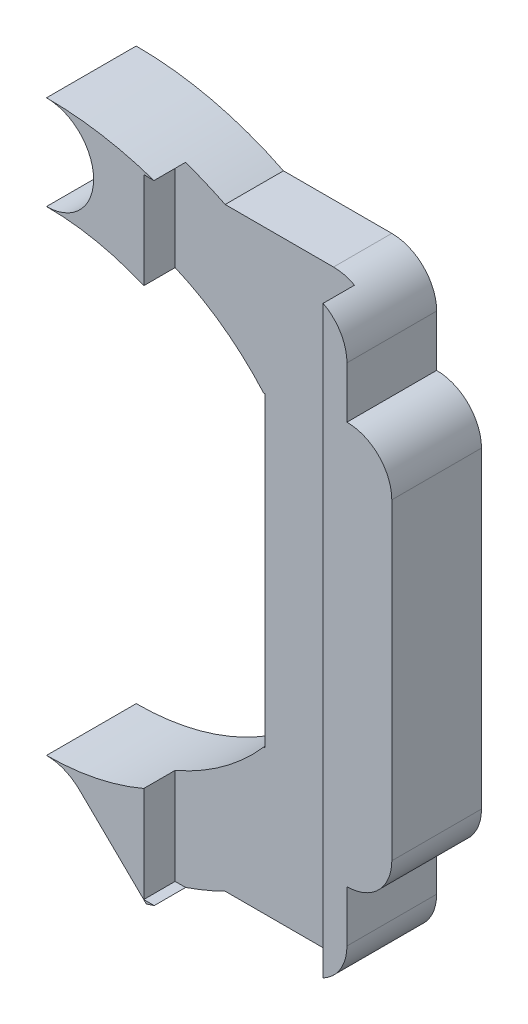
ISO-10303-21;
HEADER;
FILE_DESCRIPTION(('STEP AP214'),'2;1');
FILE_NAME('part.step','',(''),(''),'','','');
FILE_SCHEMA(('AUTOMOTIVE_DESIGN { 1 0 10303 214 1 1 1 1 }'));
ENDSEC;
DATA;
#1=APPLICATION_CONTEXT('core data for automotive mechanical design processes');
#2=APPLICATION_PROTOCOL_DEFINITION('international standard','automotive_design',2000,#1);
#3=PRODUCT_CONTEXT('',#1,'mechanical');
#4=PRODUCT('Part','Part','',(#3));
#5=PRODUCT_RELATED_PRODUCT_CATEGORY('part','',(#4));
#6=PRODUCT_DEFINITION_FORMATION('','',#4);
#7=PRODUCT_DEFINITION_CONTEXT('part definition',#1,'design');
#8=PRODUCT_DEFINITION('design','',#6,#7);
#9=PRODUCT_DEFINITION_SHAPE('','',#8);
#10=(LENGTH_UNIT() NAMED_UNIT(*) SI_UNIT(.MILLI.,.METRE.));
#11=(NAMED_UNIT(*) PLANE_ANGLE_UNIT() SI_UNIT($,.RADIAN.));
#12=(NAMED_UNIT(*) SI_UNIT($,.STERADIAN.) SOLID_ANGLE_UNIT());
#13=UNCERTAINTY_MEASURE_WITH_UNIT(LENGTH_MEASURE(1.E-05),#10,'distance_accuracy_value','');
#14=(GEOMETRIC_REPRESENTATION_CONTEXT(3) GLOBAL_UNCERTAINTY_ASSIGNED_CONTEXT((#13)) GLOBAL_UNIT_ASSIGNED_CONTEXT((#10,
#11,#12)) REPRESENTATION_CONTEXT('',''));
#15=CARTESIAN_POINT('',(0.,0.,0.));
#16=DIRECTION('',(0.,0.,1.));
#17=DIRECTION('',(1.,0.,0.));
#18=AXIS2_PLACEMENT_3D('',#15,#16,#17);
#19=CARTESIAN_POINT('',(0.,-137.488886753893,91.8986686213151));
#20=DIRECTION('',(0.,-1.,0.));
#21=DIRECTION('',(0.,0.,-1.));
#22=AXIS2_PLACEMENT_3D('',#19,#20,#21);
#23=PLANE('',#22);
#24=DIRECTION('',(-1.,0.,0.));
#25=VECTOR('',#24,1.);
#26=CARTESIAN_POINT('',(0.,-137.488886753893,6.50000000000001));
#27=LINE('',#26,#25);
#28=CARTESIAN_POINT('',(-19.5929771354829,-137.488886753893,6.50000000000001));
#29=VERTEX_POINT('',#28);
#30=CARTESIAN_POINT('',(-31.6731630647433,-137.488886753893,6.50000000000001));
#31=VERTEX_POINT('',#30);
#32=EDGE_CURVE('E290',#29,#31,#27,.T.);
#33=ORIENTED_EDGE('',*,*,#32,.F.);
#34=DIRECTION('',(0.,0.,-1.));
#35=VECTOR('',#34,1.);
#36=CARTESIAN_POINT('',(-19.5929771354829,-137.488886753893,91.8986686213151));
#37=LINE('',#36,#35);
#38=CARTESIAN_POINT('',(-19.5929771354829,-137.488886753893,0.));
#39=VERTEX_POINT('',#38);
#40=EDGE_CURVE('E344',#29,#39,#37,.T.);
#41=ORIENTED_EDGE('',*,*,#40,.T.);
#42=DIRECTION('',(-1.,0.,0.));
#43=VECTOR('',#42,1.);
#44=CARTESIAN_POINT('',(0.,-137.488886753893,0.));
#45=LINE('',#44,#43);
#46=CARTESIAN_POINT('',(-31.6731630647434,-137.488886753893,0.));
#47=VERTEX_POINT('',#46);
#48=EDGE_CURVE('E341',#39,#47,#45,.T.);
#49=ORIENTED_EDGE('',*,*,#48,.T.);
#50=DIRECTION('',(0.,0.,-1.));
#51=VECTOR('',#50,1.);
#52=CARTESIAN_POINT('',(-31.6731630647434,-137.488886753893,91.8986686213151));
#53=LINE('',#52,#51);
#54=EDGE_CURVE('E340',#31,#47,#53,.T.);
#55=ORIENTED_EDGE('',*,*,#54,.F.);
#56=EDGE_LOOP('',(#33,#41,#49,#55));
#57=FACE_BOUND('',#56,.T.);
#58=ADVANCED_FACE('F36',(#57),#23,.F.);
#59=CARTESIAN_POINT('',(10.5655699781385,-150.905438378479,91.8986686213151));
#60=DIRECTION('',(0.0698435294012636,-0.997557958918064,0.));
#61=DIRECTION('',(0.997557958918065,0.0698435294012636,0.));
#62=AXIS2_PLACEMENT_3D('',#59,#60,#61);
#63=PLANE('',#62);
#64=DIRECTION('',(0.,0.,-1.));
#65=VECTOR('',#64,1.);
#66=CARTESIAN_POINT('',(-27.2504123253833,-153.553105762856,91.8986686213151));
#67=LINE('',#66,#65);
#68=CARTESIAN_POINT('',(-27.2504123253833,-153.553105762856,6.50000000000001));
#69=VERTEX_POINT('',#68);
#70=CARTESIAN_POINT('',(-27.2504123253833,-153.553105762856,0.));
#71=VERTEX_POINT('',#70);
#72=EDGE_CURVE('E425',#69,#71,#67,.T.);
#73=ORIENTED_EDGE('',*,*,#72,.F.);
#74=DIRECTION('',(-0.997557958918065,-0.0698435294012636,0.));
#75=VECTOR('',#74,1.);
#76=CARTESIAN_POINT('',(10.5655699781385,-150.905438378479,6.50000000000001));
#77=LINE('',#76,#75);
#78=CARTESIAN_POINT('',(-27.375441214953,-153.561859599008,6.50000000000001));
#79=VERTEX_POINT('',#78);
#80=EDGE_CURVE('E282',#69,#79,#77,.T.);
#81=ORIENTED_EDGE('',*,*,#80,.T.);
#82=DIRECTION('',(0.,0.,-1.));
#83=VECTOR('',#82,1.);
#84=CARTESIAN_POINT('',(-27.375441214953,-153.561859599008,91.8986686213151));
#85=LINE('',#84,#83);
#86=CARTESIAN_POINT('',(-27.375441214953,-153.561859599008,0.));
#87=VERTEX_POINT('',#86);
#88=EDGE_CURVE('E423',#79,#87,#85,.T.);
#89=ORIENTED_EDGE('',*,*,#88,.T.);
#90=DIRECTION('',(-0.997557958918065,-0.0698435294012636,0.));
#91=VECTOR('',#90,1.);
#92=CARTESIAN_POINT('',(10.5655699781385,-150.905438378479,0.));
#93=LINE('',#92,#91);
#94=EDGE_CURVE('E325',#71,#87,#93,.T.);
#95=ORIENTED_EDGE('',*,*,#94,.F.);
#96=EDGE_LOOP('',(#73,#81,#89,#95));
#97=FACE_BOUND('',#96,.T.);
#98=ADVANCED_FACE('F467',(#97),#63,.T.);
#99=CARTESIAN_POINT('',(-27.2504123253833,0.,91.8986686213151));
#100=DIRECTION('',(-1.,0.,0.));
#101=DIRECTION('',(0.,0.,1.));
#102=AXIS2_PLACEMENT_3D('',#99,#100,#101);
#103=PLANE('',#102);
#104=DIRECTION('',(0.,0.,-1.));
#105=VECTOR('',#104,1.);
#106=CARTESIAN_POINT('',(-27.2504123253833,-187.730006102893,91.8986686213151));
#107=LINE('',#106,#105);
#108=CARTESIAN_POINT('',(-27.2504123253833,-187.730006102893,6.50000000000001));
#109=VERTEX_POINT('',#108);
#110=CARTESIAN_POINT('',(-27.2504123253833,-187.730006102893,0.));
#111=VERTEX_POINT('',#110);
#112=EDGE_CURVE('E385',#109,#111,#107,.T.);
#113=ORIENTED_EDGE('',*,*,#112,.F.);
#114=DIRECTION('',(0.,1.,0.));
#115=VECTOR('',#114,1.);
#116=CARTESIAN_POINT('',(-27.2504123253833,0.,6.50000000000001));
#117=LINE('',#116,#115);
#118=EDGE_CURVE('E279',#109,#69,#117,.T.);
#119=ORIENTED_EDGE('',*,*,#118,.T.);
#120=ORIENTED_EDGE('',*,*,#72,.T.);
#121=DIRECTION('',(0.,1.,0.));
#122=VECTOR('',#121,1.);
#123=CARTESIAN_POINT('',(-27.2504123253833,0.,0.));
#124=LINE('',#123,#122);
#125=EDGE_CURVE('E322',#111,#71,#124,.T.);
#126=ORIENTED_EDGE('',*,*,#125,.F.);
#127=EDGE_LOOP('',(#113,#119,#120,#126));
#128=FACE_BOUND('',#127,.T.);
#129=ADVANCED_FACE('F470',(#128),#103,.T.);
#130=CARTESIAN_POINT('',(0.,-187.730006102893,91.8986686213151));
#131=DIRECTION('',(0.,1.,0.));
#132=DIRECTION('',(0.,0.,1.));
#133=AXIS2_PLACEMENT_3D('',#130,#131,#132);
#134=PLANE('',#133);
#135=DIRECTION('',(0.,0.,-1.));
#136=VECTOR('',#135,1.);
#137=CARTESIAN_POINT('',(-27.375441214953,-187.730006102893,91.8986686213151));
#138=LINE('',#137,#136);
#139=CARTESIAN_POINT('',(-27.375441214953,-187.730006102893,6.50000000000001));
#140=VERTEX_POINT('',#139);
#141=CARTESIAN_POINT('',(-27.375441214953,-187.730006102893,0.));
#142=VERTEX_POINT('',#141);
#143=EDGE_CURVE('E384',#140,#142,#138,.T.);
#144=ORIENTED_EDGE('',*,*,#143,.F.);
#145=DIRECTION('',(1.,0.,0.));
#146=VECTOR('',#145,1.);
#147=CARTESIAN_POINT('',(0.,-187.730006102893,6.50000000000001));
#148=LINE('',#147,#146);
#149=EDGE_CURVE('E276',#140,#109,#148,.T.);
#150=ORIENTED_EDGE('',*,*,#149,.T.);
#151=ORIENTED_EDGE('',*,*,#112,.T.);
#152=DIRECTION('',(1.,0.,0.));
#153=VECTOR('',#152,1.);
#154=CARTESIAN_POINT('',(0.,-187.730006102893,0.));
#155=LINE('',#154,#153);
#156=EDGE_CURVE('E319',#142,#111,#155,.T.);
#157=ORIENTED_EDGE('',*,*,#156,.F.);
#158=EDGE_LOOP('',(#144,#150,#151,#157));
#159=FACE_BOUND('',#158,.T.);
#160=ADVANCED_FACE('F475',(#159),#134,.T.);
#161=CARTESIAN_POINT('',(0.,-203.802633979979,91.8986686213151));
#162=DIRECTION('',(0.,-1.,0.));
#163=DIRECTION('',(0.,0.,-1.));
#164=AXIS2_PLACEMENT_3D('',#161,#162,#163);
#165=PLANE('',#164);
#166=DIRECTION('',(0.,0.,-1.));
#167=VECTOR('',#166,1.);
#168=CARTESIAN_POINT('',(-19.5945961650131,-203.802633979979,91.8986686213151));
#169=LINE('',#168,#167);
#170=CARTESIAN_POINT('',(-19.5945961650131,-203.802633979979,6.50000000000001));
#171=VERTEX_POINT('',#170);
#172=CARTESIAN_POINT('',(-19.5945961650131,-203.802633979979,0.));
#173=VERTEX_POINT('',#172);
#174=EDGE_CURVE('E299',#171,#173,#169,.T.);
#175=ORIENTED_EDGE('',*,*,#174,.F.);
#176=DIRECTION('',(-1.,0.,0.));
#177=VECTOR('',#176,1.);
#178=CARTESIAN_POINT('',(0.,-203.802633979979,6.50000000000001));
#179=LINE('',#178,#177);
#180=CARTESIAN_POINT('',(-31.6724659617037,-203.802633979979,6.50000000000001));
#181=VERTEX_POINT('',#180);
#182=EDGE_CURVE('E270',#171,#181,#179,.T.);
#183=ORIENTED_EDGE('',*,*,#182,.T.);
#184=DIRECTION('',(0.,0.,-1.));
#185=VECTOR('',#184,1.);
#186=CARTESIAN_POINT('',(-31.6724659617037,-203.802633979979,91.8986686213151));
#187=LINE('',#186,#185);
#188=CARTESIAN_POINT('',(-31.6724659617037,-203.802633979979,0.));
#189=VERTEX_POINT('',#188);
#190=EDGE_CURVE('E307',#181,#189,#187,.T.);
#191=ORIENTED_EDGE('',*,*,#190,.T.);
#192=DIRECTION('',(-1.,0.,0.));
#193=VECTOR('',#192,1.);
#194=CARTESIAN_POINT('',(0.,-203.802633979979,0.));
#195=LINE('',#194,#193);
#196=EDGE_CURVE('E300',#173,#189,#195,.T.);
#197=ORIENTED_EDGE('',*,*,#196,.F.);
#198=EDGE_LOOP('',(#175,#183,#191,#197));
#199=FACE_BOUND('',#198,.T.);
#200=ADVANCED_FACE('F489',(#199),#165,.T.);
#201=CARTESIAN_POINT('',(0.,0.,10.));
#202=DIRECTION('',(0.,0.,1.));
#203=DIRECTION('',(1.,0.,0.));
#204=AXIS2_PLACEMENT_3D('',#201,#202,#203);
#205=PLANE('',#204);
#206=DIRECTION('',(0.,-1.,0.));
#207=VECTOR('',#206,1.);
#208=CARTESIAN_POINT('',(-37.2504123253833,-205.641555932874,10.));
#209=LINE('',#208,#207);
#210=CARTESIAN_POINT('',(-37.2504123253834,-135.641555932875,10.));
#211=VERTEX_POINT('',#210);
#212=CARTESIAN_POINT('',(-37.2504123253834,-146.373639952624,10.));
#213=VERTEX_POINT('',#212);
#214=EDGE_CURVE('E251',#211,#213,#209,.T.);
#215=ORIENTED_EDGE('',*,*,#214,.F.);
#216=DIRECTION('',(-1.,0.,0.));
#217=VECTOR('',#216,1.);
#218=CARTESIAN_POINT('',(1.87350135405495E-13,-135.641555932874,10.));
#219=LINE('',#218,#217);
#220=CARTESIAN_POINT('',(-36.105750743306,-135.641555932875,10.));
#221=VERTEX_POINT('',#220);
#222=EDGE_CURVE('E44',#221,#211,#219,.T.);
#223=ORIENTED_EDGE('',*,*,#222,.F.);
#224=CARTESIAN_POINT('',(-48.0929771354814,-170.645932850957,9.99999999999999));
#225=DIRECTION('',(0.,0.,1.));
#226=DIRECTION('',(1.,0.,0.));
#227=AXIS2_PLACEMENT_3D('',#224,#225,#226);
#228=CIRCLE('',#227,37.0000000000059);
#229=CARTESIAN_POINT('',(-48.0929771354812,-133.645932850951,9.99999999999999));
#230=VERTEX_POINT('',#229);
#231=EDGE_CURVE('E390',#221,#230,#228,.T.);
#232=ORIENTED_EDGE('',*,*,#231,.T.);
#233=CARTESIAN_POINT('',(-48.0929771354814,-138.895932850951,9.99999999999999));
#234=DIRECTION('',(0.,0.,1.));
#235=DIRECTION('',(1.,0.,0.));
#236=AXIS2_PLACEMENT_3D('',#233,#234,#235);
#237=CIRCLE('',#236,5.25);
#238=CARTESIAN_POINT('',(-48.0929771354816,-144.145932850951,9.99999999999999));
#239=VERTEX_POINT('',#238);
#240=EDGE_CURVE('E380',#230,#239,#237,.F.);
#241=ORIENTED_EDGE('',*,*,#240,.T.);
#242=CARTESIAN_POINT('',(-48.0929771354814,-171.645932850951,9.99999999999999));
#243=DIRECTION('',(0.,0.,1.));
#244=DIRECTION('',(1.,0.,0.));
#245=AXIS2_PLACEMENT_3D('',#242,#243,#244);
#246=CIRCLE('',#245,27.5);
#247=EDGE_CURVE('E335',#213,#239,#246,.T.);
#248=ORIENTED_EDGE('',*,*,#247,.F.);
#249=EDGE_LOOP('',(#215,#223,#232,#241,#248));
#250=FACE_BOUND('',#249,.T.);
#251=ADVANCED_FACE('F450',(#250),#205,.T.);
#252=DIRECTION('',(0.,1.,0.));
#253=VECTOR('',#252,1.);
#254=CARTESIAN_POINT('',(-17.2504123253834,0.,10.));
#255=LINE('',#254,#253);
#256=CARTESIAN_POINT('',(-17.2504123253833,-203.219058113373,10.));
#257=VERTEX_POINT('',#256);
#258=CARTESIAN_POINT('',(-17.2504123253833,-138.071603639751,10.));
#259=VERTEX_POINT('',#258);
#260=EDGE_CURVE('E436',#257,#259,#255,.T.);
#261=ORIENTED_EDGE('',*,*,#260,.F.);
#262=CARTESIAN_POINT('',(-19.594596165013,-198.802633979979,9.99999999999999));
#263=DIRECTION('',(0.,0.,1.));
#264=DIRECTION('',(1.,0.,0.));
#265=AXIS2_PLACEMENT_3D('',#262,#263,#264);
#266=CIRCLE('',#265,5.);
#267=CARTESIAN_POINT('',(-14.594596165013,-198.802633979979,9.99999999999999));
#268=VERTEX_POINT('',#267);
#269=EDGE_CURVE('E59',#257,#268,#266,.T.);
#270=ORIENTED_EDGE('',*,*,#269,.T.);
#271=DIRECTION('',(0.,-1.,0.));
#272=VECTOR('',#271,1.);
#273=CARTESIAN_POINT('',(-14.594596165013,0.,9.99999999999999));
#274=LINE('',#273,#272);
#275=CARTESIAN_POINT('',(-14.594596165013,-193.072403439186,9.99999999999999));
#276=VERTEX_POINT('',#275);
#277=EDGE_CURVE('E294',#276,#268,#274,.T.);
#278=ORIENTED_EDGE('',*,*,#277,.F.);
#279=DIRECTION('',(1.,0.,0.));
#280=VECTOR('',#279,1.);
#281=CARTESIAN_POINT('',(0.,-193.072403439186,9.99999999999999));
#282=LINE('',#281,#280);
#283=CARTESIAN_POINT('',(-14.5929771354816,-193.072403439186,9.99999999999999));
#284=VERTEX_POINT('',#283);
#285=EDGE_CURVE('E331',#276,#284,#282,.T.);
#286=ORIENTED_EDGE('',*,*,#285,.T.);
#287=CARTESIAN_POINT('',(-14.5929771354816,-188.072403439186,9.99999999999999));
#288=DIRECTION('',(0.,0.,1.));
#289=DIRECTION('',(1.,0.,0.));
#290=AXIS2_PLACEMENT_3D('',#287,#288,#289);
#291=CIRCLE('',#290,5.);
#292=CARTESIAN_POINT('',(-9.59297713548164,-188.072403439186,9.99999999999999));
#293=VERTEX_POINT('',#292);
#294=EDGE_CURVE('E404',#284,#293,#291,.T.);
#295=ORIENTED_EDGE('',*,*,#294,.T.);
#296=DIRECTION('',(0.,1.,0.));
#297=VECTOR('',#296,1.);
#298=CARTESIAN_POINT('',(-9.59297713548166,0.,9.99999999999999));
#299=LINE('',#298,#297);
#300=CARTESIAN_POINT('',(-9.59297713548165,-153.219462262715,9.99999999999999));
#301=VERTEX_POINT('',#300);
#302=EDGE_CURVE('E401',#293,#301,#299,.T.);
#303=ORIENTED_EDGE('',*,*,#302,.T.);
#304=CARTESIAN_POINT('',(-14.5929771354816,-153.219462262715,9.99999999999999));
#305=DIRECTION('',(0.,0.,1.));
#306=DIRECTION('',(1.,0.,0.));
#307=AXIS2_PLACEMENT_3D('',#304,#305,#306);
#308=CIRCLE('',#307,5.);
#309=CARTESIAN_POINT('',(-14.5929771354816,-148.219462262715,9.99999999999999));
#310=VERTEX_POINT('',#309);
#311=EDGE_CURVE('E398',#301,#310,#308,.T.);
#312=ORIENTED_EDGE('',*,*,#311,.T.);
#313=DIRECTION('',(-2.06753428563697E-13,1.,0.));
#314=VECTOR('',#313,1.);
#315=CARTESIAN_POINT('',(-14.5929771355123,-3.02535774210355E-12,9.99999999999999));
#316=LINE('',#315,#314);
#317=CARTESIAN_POINT('',(-14.5929771354828,-142.488886753893,9.99999999999999));
#318=VERTEX_POINT('',#317);
#319=EDGE_CURVE('E395',#310,#318,#316,.T.);
#320=ORIENTED_EDGE('',*,*,#319,.T.);
#321=CARTESIAN_POINT('',(-19.5929771354828,-142.488886753893,9.99999999999999));
#322=DIRECTION('',(0.,0.,1.));
#323=DIRECTION('',(1.,0.,0.));
#324=AXIS2_PLACEMENT_3D('',#321,#322,#323);
#325=CIRCLE('',#324,5.);
#326=EDGE_CURVE('E392',#318,#259,#325,.T.);
#327=ORIENTED_EDGE('',*,*,#326,.T.);
#328=EDGE_LOOP('',(#261,#270,#278,#286,#295,#303,#312,#320,#327));
#329=FACE_BOUND('',#328,.T.);
#330=ADVANCED_FACE('F504',(#329),#205,.T.);
#331=CARTESIAN_POINT('',(-14.594596165013,0.,91.8986686213151));
#332=DIRECTION('',(1.,0.,0.));
#333=DIRECTION('',(0.,0.,-1.));
#334=AXIS2_PLACEMENT_3D('',#331,#332,#333);
#335=PLANE('',#334);
#336=DIRECTION('',(0.,0.,-1.));
#337=VECTOR('',#336,1.);
#338=CARTESIAN_POINT('',(-14.594596165013,-193.072403439186,91.8986686213151));
#339=LINE('',#338,#337);
#340=CARTESIAN_POINT('',(-14.594596165013,-193.072403439186,0.));
#341=VERTEX_POINT('',#340);
#342=EDGE_CURVE('E368',#276,#341,#339,.T.);
#343=ORIENTED_EDGE('',*,*,#342,.F.);
#344=ORIENTED_EDGE('',*,*,#277,.T.);
#345=DIRECTION('',(0.,0.,-1.));
#346=VECTOR('',#345,1.);
#347=CARTESIAN_POINT('',(-14.594596165013,-198.802633979979,91.8986686213151));
#348=LINE('',#347,#346);
#349=CARTESIAN_POINT('',(-14.594596165013,-198.802633979979,0.));
#350=VERTEX_POINT('',#349);
#351=EDGE_CURVE('E411',#268,#350,#348,.T.);
#352=ORIENTED_EDGE('',*,*,#351,.T.);
#353=DIRECTION('',(0.,-1.,0.));
#354=VECTOR('',#353,1.);
#355=CARTESIAN_POINT('',(-14.594596165013,0.,0.));
#356=LINE('',#355,#354);
#357=EDGE_CURVE('E298',#341,#350,#356,.T.);
#358=ORIENTED_EDGE('',*,*,#357,.F.);
#359=EDGE_LOOP('',(#343,#344,#352,#358));
#360=FACE_BOUND('',#359,.T.);
#361=ADVANCED_FACE('F500',(#360),#335,.T.);
#362=CARTESIAN_POINT('',(0.,-193.072403439186,91.8986686213151));
#363=DIRECTION('',(0.,1.,0.));
#364=DIRECTION('',(0.,0.,1.));
#365=AXIS2_PLACEMENT_3D('',#362,#363,#364);
#366=PLANE('',#365);
#367=ORIENTED_EDGE('',*,*,#285,.F.);
#368=ORIENTED_EDGE('',*,*,#342,.T.);
#369=DIRECTION('',(1.,0.,0.));
#370=VECTOR('',#369,1.);
#371=CARTESIAN_POINT('',(0.,-193.072403439186,0.));
#372=LINE('',#371,#370);
#373=CARTESIAN_POINT('',(-14.5929771354816,-193.072403439186,0.));
#374=VERTEX_POINT('',#373);
#375=EDGE_CURVE('E365',#341,#374,#372,.T.);
#376=ORIENTED_EDGE('',*,*,#375,.T.);
#377=DIRECTION('',(0.,0.,-1.));
#378=VECTOR('',#377,1.);
#379=CARTESIAN_POINT('',(-14.5929771354816,-193.072403439186,91.8986686213151));
#380=LINE('',#379,#378);
#381=EDGE_CURVE('E364',#284,#374,#380,.T.);
#382=ORIENTED_EDGE('',*,*,#381,.F.);
#383=EDGE_LOOP('',(#367,#368,#376,#382));
#384=FACE_BOUND('',#383,.T.);
#385=ADVANCED_FACE('F551',(#384),#366,.F.);
#386=CARTESIAN_POINT('',(-14.5929771354816,-188.072403439186,91.8986686213151));
#387=DIRECTION('',(0.,0.,-1.));
#388=DIRECTION('',(-1.,0.,0.));
#389=AXIS2_PLACEMENT_3D('',#386,#387,#388);
#390=CYLINDRICAL_SURFACE('',#389,5.);
#391=ORIENTED_EDGE('',*,*,#294,.F.);
#392=ORIENTED_EDGE('',*,*,#381,.T.);
#393=CARTESIAN_POINT('',(-14.5929771354816,-188.072403439186,0.));
#394=DIRECTION('',(0.,0.,1.));
#395=DIRECTION('',(1.,0.,0.));
#396=AXIS2_PLACEMENT_3D('',#393,#394,#395);
#397=CIRCLE('',#396,5.);
#398=CARTESIAN_POINT('',(-9.59297713548164,-188.072403439186,0.));
#399=VERTEX_POINT('',#398);
#400=EDGE_CURVE('E361',#374,#399,#397,.T.);
#401=ORIENTED_EDGE('',*,*,#400,.T.);
#402=DIRECTION('',(0.,0.,-1.));
#403=VECTOR('',#402,1.);
#404=CARTESIAN_POINT('',(-9.59297713548164,-188.072403439186,91.8986686213151));
#405=LINE('',#404,#403);
#406=EDGE_CURVE('E360',#293,#399,#405,.T.);
#407=ORIENTED_EDGE('',*,*,#406,.F.);
#408=EDGE_LOOP('',(#391,#392,#401,#407));
#409=FACE_BOUND('',#408,.T.);
#410=ADVANCED_FACE('F547',(#409),#390,.T.);
#411=CARTESIAN_POINT('',(-9.59297713548166,0.,91.8986686213151));
#412=DIRECTION('',(-1.,0.,0.));
#413=DIRECTION('',(0.,-1.,0.));
#414=AXIS2_PLACEMENT_3D('',#411,#412,#413);
#415=PLANE('',#414);
#416=ORIENTED_EDGE('',*,*,#302,.F.);
#417=ORIENTED_EDGE('',*,*,#406,.T.);
#418=DIRECTION('',(0.,1.,0.));
#419=VECTOR('',#418,1.);
#420=CARTESIAN_POINT('',(-9.59297713548166,0.,0.));
#421=LINE('',#420,#419);
#422=CARTESIAN_POINT('',(-9.59297713548165,-153.219462262715,0.));
#423=VERTEX_POINT('',#422);
#424=EDGE_CURVE('E357',#399,#423,#421,.T.);
#425=ORIENTED_EDGE('',*,*,#424,.T.);
#426=DIRECTION('',(0.,0.,-1.));
#427=VECTOR('',#426,1.);
#428=CARTESIAN_POINT('',(-9.59297713548165,-153.219462262715,91.8986686213151));
#429=LINE('',#428,#427);
#430=EDGE_CURVE('E356',#301,#423,#429,.T.);
#431=ORIENTED_EDGE('',*,*,#430,.F.);
#432=EDGE_LOOP('',(#416,#417,#425,#431));
#433=FACE_BOUND('',#432,.T.);
#434=ADVANCED_FACE('F543',(#433),#415,.F.);
#435=CARTESIAN_POINT('',(-14.5929771354816,-153.219462262715,91.8986686213151));
#436=DIRECTION('',(0.,0.,-1.));
#437=DIRECTION('',(-1.,0.,0.));
#438=AXIS2_PLACEMENT_3D('',#435,#436,#437);
#439=CYLINDRICAL_SURFACE('',#438,5.);
#440=ORIENTED_EDGE('',*,*,#311,.F.);
#441=ORIENTED_EDGE('',*,*,#430,.T.);
#442=CARTESIAN_POINT('',(-14.5929771354816,-153.219462262715,0.));
#443=DIRECTION('',(0.,0.,1.));
#444=DIRECTION('',(1.,0.,0.));
#445=AXIS2_PLACEMENT_3D('',#442,#443,#444);
#446=CIRCLE('',#445,5.);
#447=CARTESIAN_POINT('',(-14.5929771354816,-148.219462262715,0.));
#448=VERTEX_POINT('',#447);
#449=EDGE_CURVE('E353',#423,#448,#446,.T.);
#450=ORIENTED_EDGE('',*,*,#449,.T.);
#451=DIRECTION('',(0.,0.,-1.));
#452=VECTOR('',#451,1.);
#453=CARTESIAN_POINT('',(-14.5929771354816,-148.219462262715,91.8986686213151));
#454=LINE('',#453,#452);
#455=EDGE_CURVE('E352',#310,#448,#454,.T.);
#456=ORIENTED_EDGE('',*,*,#455,.F.);
#457=EDGE_LOOP('',(#440,#441,#450,#456));
#458=FACE_BOUND('',#457,.T.);
#459=ADVANCED_FACE('F540',(#458),#439,.T.);
#460=CARTESIAN_POINT('',(-14.5929771355123,-3.02535774210355E-12,91.8986686213151));
#461=DIRECTION('',(-1.,-2.06753428563697E-13,0.));
#462=DIRECTION('',(2.06753428563697E-13,-1.,0.));
#463=AXIS2_PLACEMENT_3D('',#460,#461,#462);
#464=PLANE('',#463);
#465=ORIENTED_EDGE('',*,*,#319,.F.);
#466=ORIENTED_EDGE('',*,*,#455,.T.);
#467=DIRECTION('',(-2.06753428563697E-13,1.,0.));
#468=VECTOR('',#467,1.);
#469=CARTESIAN_POINT('',(-14.5929771355123,-3.02535774210355E-12,0.));
#470=LINE('',#469,#468);
#471=CARTESIAN_POINT('',(-14.5929771354828,-142.488886753893,0.));
#472=VERTEX_POINT('',#471);
#473=EDGE_CURVE('E349',#448,#472,#470,.T.);
#474=ORIENTED_EDGE('',*,*,#473,.T.);
#475=DIRECTION('',(0.,0.,-1.));
#476=VECTOR('',#475,1.);
#477=CARTESIAN_POINT('',(-14.5929771354828,-142.488886753893,91.8986686213151));
#478=LINE('',#477,#476);
#479=EDGE_CURVE('E348',#318,#472,#478,.T.);
#480=ORIENTED_EDGE('',*,*,#479,.F.);
#481=EDGE_LOOP('',(#465,#466,#474,#480));
#482=FACE_BOUND('',#481,.T.);
#483=ADVANCED_FACE('F510',(#482),#464,.F.);
#484=CARTESIAN_POINT('',(-19.5929771354828,-142.488886753893,91.8986686213151));
#485=DIRECTION('',(0.,0.,-1.));
#486=DIRECTION('',(-1.,0.,0.));
#487=AXIS2_PLACEMENT_3D('',#484,#485,#486);
#488=CYLINDRICAL_SURFACE('',#487,5.);
#489=CARTESIAN_POINT('',(-19.5929771354828,-142.488886753893,6.50000000000001));
#490=DIRECTION('',(0.,0.,1.));
#491=DIRECTION('',(1.,0.,0.));
#492=AXIS2_PLACEMENT_3D('',#489,#490,#491);
#493=CIRCLE('',#492,5.);
#494=CARTESIAN_POINT('',(-17.2504123253833,-138.071603639751,6.50000000000001));
#495=VERTEX_POINT('',#494);
#496=EDGE_CURVE('E292',#495,#29,#493,.T.);
#497=ORIENTED_EDGE('',*,*,#496,.F.);
#498=DIRECTION('',(0.,0.,-1.));
#499=VECTOR('',#498,1.);
#500=CARTESIAN_POINT('',(-17.2504123253833,-138.071603639751,91.8986686213151));
#501=LINE('',#500,#499);
#502=EDGE_CURVE('E260',#495,#259,#501,.F.);
#503=ORIENTED_EDGE('',*,*,#502,.T.);
#504=ORIENTED_EDGE('',*,*,#326,.F.);
#505=ORIENTED_EDGE('',*,*,#479,.T.);
#506=CARTESIAN_POINT('',(-19.5929771354828,-142.488886753893,0.));
#507=DIRECTION('',(0.,0.,1.));
#508=DIRECTION('',(1.,0.,0.));
#509=AXIS2_PLACEMENT_3D('',#506,#507,#508);
#510=CIRCLE('',#509,5.);
#511=EDGE_CURVE('E345',#472,#39,#510,.T.);
#512=ORIENTED_EDGE('',*,*,#511,.T.);
#513=ORIENTED_EDGE('',*,*,#40,.F.);
#514=EDGE_LOOP('',(#497,#503,#504,#505,#512,#513));
#515=FACE_BOUND('',#514,.T.);
#516=ADVANCED_FACE('F508',(#515),#488,.T.);
#517=CARTESIAN_POINT('',(-48.0929771354814,-170.645932850957,91.8986686213151));
#518=DIRECTION('',(0.,0.,-1.));
#519=DIRECTION('',(-1.,0.,0.));
#520=AXIS2_PLACEMENT_3D('',#517,#518,#519);
#521=CYLINDRICAL_SURFACE('',#520,37.0000000000059);
#522=ORIENTED_EDGE('',*,*,#231,.F.);
#523=DIRECTION('',(0.,0.,-1.));
#524=VECTOR('',#523,1.);
#525=CARTESIAN_POINT('',(-36.105750743306,-135.641555932875,91.8986686213151));
#526=LINE('',#525,#524);
#527=CARTESIAN_POINT('',(-36.105750743306,-135.641555932875,6.50000000000001));
#528=VERTEX_POINT('',#527);
#529=EDGE_CURVE('E263',#221,#528,#526,.T.);
#530=ORIENTED_EDGE('',*,*,#529,.T.);
#531=CARTESIAN_POINT('',(-48.0929771354814,-170.645932850957,6.50000000000001));
#532=DIRECTION('',(0.,0.,1.));
#533=DIRECTION('',(1.,0.,0.));
#534=AXIS2_PLACEMENT_3D('',#531,#532,#533);
#535=CIRCLE('',#534,37.0000000000059);
#536=EDGE_CURVE('E288',#31,#528,#535,.T.);
#537=ORIENTED_EDGE('',*,*,#536,.F.);
#538=ORIENTED_EDGE('',*,*,#54,.T.);
#539=CARTESIAN_POINT('',(-48.0929771354814,-170.645932850957,0.));
#540=DIRECTION('',(0.,0.,1.));
#541=DIRECTION('',(1.,0.,0.));
#542=AXIS2_PLACEMENT_3D('',#539,#540,#541);
#543=CIRCLE('',#542,37.0000000000059);
#544=CARTESIAN_POINT('',(-48.0929771354812,-133.645932850951,0.));
#545=VERTEX_POINT('',#544);
#546=EDGE_CURVE('E337',#47,#545,#543,.T.);
#547=ORIENTED_EDGE('',*,*,#546,.T.);
#548=DIRECTION('',(0.,0.,-1.));
#549=VECTOR('',#548,1.);
#550=CARTESIAN_POINT('',(-48.0929771354812,-133.645932850951,91.8986686213151));
#551=LINE('',#550,#549);
#552=EDGE_CURVE('E336',#230,#545,#551,.T.);
#553=ORIENTED_EDGE('',*,*,#552,.F.);
#554=EDGE_LOOP('',(#522,#530,#537,#538,#547,#553));
#555=FACE_BOUND('',#554,.T.);
#556=ADVANCED_FACE('F522',(#555),#521,.T.);
#557=CARTESIAN_POINT('',(-48.0929771354814,-138.895932850951,91.8986686213151));
#558=DIRECTION('',(0.,0.,-1.));
#559=DIRECTION('',(-1.,0.,0.));
#560=AXIS2_PLACEMENT_3D('',#557,#558,#559);
#561=CYLINDRICAL_SURFACE('',#560,5.25);
#562=ORIENTED_EDGE('',*,*,#240,.F.);
#563=ORIENTED_EDGE('',*,*,#552,.T.);
#564=CARTESIAN_POINT('',(-48.0929771354814,-138.895932850951,0.));
#565=DIRECTION('',(0.,0.,1.));
#566=DIRECTION('',(1.,0.,0.));
#567=AXIS2_PLACEMENT_3D('',#564,#565,#566);
#568=CIRCLE('',#567,5.25);
#569=CARTESIAN_POINT('',(-48.0929771354816,-144.145932850951,0.));
#570=VERTEX_POINT('',#569);
#571=EDGE_CURVE('E332',#545,#570,#568,.F.);
#572=ORIENTED_EDGE('',*,*,#571,.T.);
#573=DIRECTION('',(0.,0.,-1.));
#574=VECTOR('',#573,1.);
#575=CARTESIAN_POINT('',(-48.0929771354816,-144.145932850951,91.8986686213151));
#576=LINE('',#575,#574);
#577=EDGE_CURVE('E387',#239,#570,#576,.T.);
#578=ORIENTED_EDGE('',*,*,#577,.F.);
#579=EDGE_LOOP('',(#562,#563,#572,#578));
#580=FACE_BOUND('',#579,.T.);
#581=ADVANCED_FACE('F457',(#580),#561,.F.);
#582=CARTESIAN_POINT('',(-48.0929771354814,-171.645932850951,91.8986686213151));
#583=DIRECTION('',(0.,0.,-1.));
#584=DIRECTION('',(-1.,0.,0.));
#585=AXIS2_PLACEMENT_3D('',#582,#583,#584);
#586=CYLINDRICAL_SURFACE('',#585,27.5);
#587=DIRECTION('',(0.,0.,-1.));
#588=VECTOR('',#587,1.);
#589=CARTESIAN_POINT('',(-37.2504123253834,-146.373639952624,91.8986686213151));
#590=LINE('',#589,#588);
#591=CARTESIAN_POINT('',(-37.2504123253834,-146.373639952624,6.50000000000001));
#592=VERTEX_POINT('',#591);
#593=EDGE_CURVE('E268',#213,#592,#590,.T.);
#594=ORIENTED_EDGE('',*,*,#593,.F.);
#595=ORIENTED_EDGE('',*,*,#247,.T.);
#596=ORIENTED_EDGE('',*,*,#577,.T.);
#597=CARTESIAN_POINT('',(-48.0929771354814,-171.645932850951,0.));
#598=DIRECTION('',(0.,0.,1.));
#599=DIRECTION('',(1.,0.,0.));
#600=AXIS2_PLACEMENT_3D('',#597,#598,#599);
#601=CIRCLE('',#600,27.5);
#602=EDGE_CURVE('E328',#87,#570,#601,.T.);
#603=ORIENTED_EDGE('',*,*,#602,.F.);
#604=ORIENTED_EDGE('',*,*,#88,.F.);
#605=CARTESIAN_POINT('',(-48.0929771354814,-171.645932850951,6.50000000000001));
#606=DIRECTION('',(0.,0.,1.));
#607=DIRECTION('',(1.,0.,0.));
#608=AXIS2_PLACEMENT_3D('',#605,#606,#607);
#609=CIRCLE('',#608,27.5);
#610=EDGE_CURVE('E285',#79,#592,#609,.T.);
#611=ORIENTED_EDGE('',*,*,#610,.T.);
#612=EDGE_LOOP('',(#594,#595,#596,#603,#604,#611));
#613=FACE_BOUND('',#612,.T.);
#614=ADVANCED_FACE('F454',(#613),#586,.F.);
#615=CARTESIAN_POINT('',(-48.0929771354814,-169.645932850951,91.8986686213151));
#616=DIRECTION('',(0.,0.,-1.));
#617=DIRECTION('',(-1.,0.,0.));
#618=AXIS2_PLACEMENT_3D('',#615,#616,#617);
#619=CYLINDRICAL_SURFACE('',#618,27.5);
#620=DIRECTION('',(0.,0.,-1.));
#621=VECTOR('',#620,1.);
#622=CARTESIAN_POINT('',(-37.2504123253833,-194.918225749277,91.8986686213151));
#623=LINE('',#622,#621);
#624=CARTESIAN_POINT('',(-37.2504123253833,-194.918225749277,6.50000000000001));
#625=VERTEX_POINT('',#624);
#626=CARTESIAN_POINT('',(-37.2504123253833,-194.918225749277,10.));
#627=VERTEX_POINT('',#626);
#628=EDGE_CURVE('E266',#625,#627,#623,.F.);
#629=ORIENTED_EDGE('',*,*,#628,.F.);
#630=CARTESIAN_POINT('',(-48.0929771354814,-169.645932850951,6.50000000000001));
#631=DIRECTION('',(0.,0.,1.));
#632=DIRECTION('',(1.,0.,0.));
#633=AXIS2_PLACEMENT_3D('',#630,#631,#632);
#634=CIRCLE('',#633,27.5);
#635=EDGE_CURVE('E228',#625,#140,#634,.T.);
#636=ORIENTED_EDGE('',*,*,#635,.T.);
#637=ORIENTED_EDGE('',*,*,#143,.T.);
#638=CARTESIAN_POINT('',(-48.0929771354814,-169.645932850951,0.));
#639=DIRECTION('',(0.,0.,1.));
#640=DIRECTION('',(1.,0.,0.));
#641=AXIS2_PLACEMENT_3D('',#638,#639,#640);
#642=CIRCLE('',#641,27.5);
#643=CARTESIAN_POINT('',(-48.0929771354816,-197.145932850951,0.));
#644=VERTEX_POINT('',#643);
#645=EDGE_CURVE('E303',#644,#142,#642,.T.);
#646=ORIENTED_EDGE('',*,*,#645,.F.);
#647=DIRECTION('',(0.,0.,-1.));
#648=VECTOR('',#647,1.);
#649=CARTESIAN_POINT('',(-48.0929771354816,-197.145932850951,91.8986686213151));
#650=LINE('',#649,#648);
#651=CARTESIAN_POINT('',(-48.0929771354816,-197.145932850951,9.99999999999999));
#652=VERTEX_POINT('',#651);
#653=EDGE_CURVE('E316',#652,#644,#650,.T.);
#654=ORIENTED_EDGE('',*,*,#653,.F.);
#655=CARTESIAN_POINT('',(-48.0929771354814,-169.645932850951,9.99999999999999));
#656=DIRECTION('',(0.,0.,1.));
#657=DIRECTION('',(1.,0.,0.));
#658=AXIS2_PLACEMENT_3D('',#655,#656,#657);
#659=CIRCLE('',#658,27.5);
#660=EDGE_CURVE('E381',#652,#627,#659,.T.);
#661=ORIENTED_EDGE('',*,*,#660,.T.);
#662=EDGE_LOOP('',(#629,#636,#637,#646,#654,#661));
#663=FACE_BOUND('',#662,.T.);
#664=ADVANCED_FACE('F477',(#663),#619,.F.);
#665=CARTESIAN_POINT('',(-48.0929771354814,-202.395932850951,91.8986686213151));
#666=DIRECTION('',(0.,0.,-1.));
#667=DIRECTION('',(-1.,0.,0.));
#668=AXIS2_PLACEMENT_3D('',#665,#666,#667);
#669=CYLINDRICAL_SURFACE('',#668,5.25);
#670=CARTESIAN_POINT('',(-48.0929771354814,-202.395932850951,9.99999999999999));
#671=DIRECTION('',(0.,0.,1.));
#672=DIRECTION('',(1.,0.,0.));
#673=AXIS2_PLACEMENT_3D('',#670,#671,#672);
#674=CIRCLE('',#673,5.25);
#675=CARTESIAN_POINT('',(-44.3806658700032,-198.683622147411,9.99999999999999));
#676=VERTEX_POINT('',#675);
#677=EDGE_CURVE('E377',#652,#676,#674,.F.);
#678=ORIENTED_EDGE('',*,*,#677,.F.);
#679=ORIENTED_EDGE('',*,*,#653,.T.);
#680=CARTESIAN_POINT('',(-48.0929771354814,-202.395932850951,0.));
#681=DIRECTION('',(0.,0.,1.));
#682=DIRECTION('',(1.,0.,0.));
#683=AXIS2_PLACEMENT_3D('',#680,#681,#682);
#684=CIRCLE('',#683,5.25);
#685=CARTESIAN_POINT('',(-44.3806658700032,-198.683622147411,0.));
#686=VERTEX_POINT('',#685);
#687=EDGE_CURVE('E313',#644,#686,#684,.F.);
#688=ORIENTED_EDGE('',*,*,#687,.T.);
#689=DIRECTION('',(0.,0.,-1.));
#690=VECTOR('',#689,1.);
#691=CARTESIAN_POINT('',(-44.3806658700032,-198.683622147411,91.8986686213151));
#692=LINE('',#691,#690);
#693=EDGE_CURVE('E312',#676,#686,#692,.T.);
#694=ORIENTED_EDGE('',*,*,#693,.F.);
#695=EDGE_LOOP('',(#678,#679,#688,#694));
#696=FACE_BOUND('',#695,.T.);
#697=ADVANCED_FACE('F583',(#696),#669,.F.);
#698=CARTESIAN_POINT('',(-120.97813479974,-123.881096024638,91.8986686213151));
#699=DIRECTION('',(0.698674482826105,0.715439701895048,0.));
#700=DIRECTION('',(-0.715439701895048,0.698674482826105,0.));
#701=AXIS2_PLACEMENT_3D('',#698,#699,#700);
#702=PLANE('',#701);
#703=DIRECTION('',(0.715439701895048,-0.698674482826105,0.));
#704=VECTOR('',#703,1.);
#705=CARTESIAN_POINT('',(-120.97813479974,-123.881096024638,9.99999999999999));
#706=LINE('',#705,#704);
#707=CARTESIAN_POINT('',(-36.9593039046248,-205.931076012903,9.99999999999999));
#708=VERTEX_POINT('',#707);
#709=EDGE_CURVE('E374',#676,#708,#706,.T.);
#710=ORIENTED_EDGE('',*,*,#709,.F.);
#711=ORIENTED_EDGE('',*,*,#693,.T.);
#712=DIRECTION('',(0.715439701895048,-0.698674482826105,0.));
#713=VECTOR('',#712,1.);
#714=CARTESIAN_POINT('',(-120.97813479974,-123.881096024638,0.));
#715=LINE('',#714,#713);
#716=CARTESIAN_POINT('',(-36.9593039046248,-205.931076012903,0.));
#717=VERTEX_POINT('',#716);
#718=EDGE_CURVE('E309',#686,#717,#715,.T.);
#719=ORIENTED_EDGE('',*,*,#718,.T.);
#720=DIRECTION('',(0.,0.,-1.));
#721=VECTOR('',#720,1.);
#722=CARTESIAN_POINT('',(-36.9593039046248,-205.931076012903,91.8986686213151));
#723=LINE('',#722,#721);
#724=EDGE_CURVE('E308',#708,#717,#723,.T.);
#725=ORIENTED_EDGE('',*,*,#724,.F.);
#726=EDGE_LOOP('',(#710,#711,#719,#725));
#727=FACE_BOUND('',#726,.T.);
#728=ADVANCED_FACE('F580',(#727),#702,.F.);
#729=CARTESIAN_POINT('',(-48.0929771354814,-170.645930643476,91.8986686213151));
#730=DIRECTION('',(0.,0.,-1.));
#731=DIRECTION('',(-1.,0.,0.));
#732=AXIS2_PLACEMENT_3D('',#729,#730,#731);
#733=CYLINDRICAL_SURFACE('',#732,37.0000022074742);
#734=CARTESIAN_POINT('',(-48.0929771354814,-170.645930643476,6.50000000000001));
#735=DIRECTION('',(0.,0.,1.));
#736=DIRECTION('',(1.,0.,0.));
#737=AXIS2_PLACEMENT_3D('',#734,#735,#736);
#738=CIRCLE('',#737,37.0000022074742);
#739=CARTESIAN_POINT('',(-36.0802183367248,-205.641555932874,6.50000000000001));
#740=VERTEX_POINT('',#739);
#741=EDGE_CURVE('E273',#740,#181,#738,.T.);
#742=ORIENTED_EDGE('',*,*,#741,.F.);
#743=DIRECTION('',(0.,0.,-1.));
#744=VECTOR('',#743,1.);
#745=CARTESIAN_POINT('',(-36.0802183367249,-205.641555932874,91.8986686213151));
#746=LINE('',#745,#744);
#747=CARTESIAN_POINT('',(-36.0802183367248,-205.641555932874,10.));
#748=VERTEX_POINT('',#747);
#749=EDGE_CURVE('E243',#740,#748,#746,.F.);
#750=ORIENTED_EDGE('',*,*,#749,.T.);
#751=CARTESIAN_POINT('',(-48.0929771354814,-170.645930643476,9.99999999999999));
#752=DIRECTION('',(0.,0.,1.));
#753=DIRECTION('',(1.,0.,0.));
#754=AXIS2_PLACEMENT_3D('',#751,#752,#753);
#755=CIRCLE('',#754,37.0000022074742);
#756=EDGE_CURVE('E371',#708,#748,#755,.T.);
#757=ORIENTED_EDGE('',*,*,#756,.F.);
#758=ORIENTED_EDGE('',*,*,#724,.T.);
#759=CARTESIAN_POINT('',(-48.0929771354814,-170.645930643476,0.));
#760=DIRECTION('',(0.,0.,1.));
#761=DIRECTION('',(1.,0.,0.));
#762=AXIS2_PLACEMENT_3D('',#759,#760,#761);
#763=CIRCLE('',#762,37.0000022074742);
#764=EDGE_CURVE('E304',#717,#189,#763,.T.);
#765=ORIENTED_EDGE('',*,*,#764,.T.);
#766=ORIENTED_EDGE('',*,*,#190,.F.);
#767=EDGE_LOOP('',(#742,#750,#757,#758,#765,#766));
#768=FACE_BOUND('',#767,.T.);
#769=ADVANCED_FACE('F483',(#768),#733,.T.);
#770=CARTESIAN_POINT('',(-19.594596165013,-198.802633979979,91.8986686213151));
#771=DIRECTION('',(0.,0.,-1.));
#772=DIRECTION('',(-1.,0.,0.));
#773=AXIS2_PLACEMENT_3D('',#770,#771,#772);
#774=CYLINDRICAL_SURFACE('',#773,5.);
#775=ORIENTED_EDGE('',*,*,#269,.F.);
#776=DIRECTION('',(0.,0.,-1.));
#777=VECTOR('',#776,1.);
#778=CARTESIAN_POINT('',(-17.2504123253833,-203.219058113373,91.8986686213151));
#779=LINE('',#778,#777);
#780=CARTESIAN_POINT('',(-17.2504123253833,-203.219058113373,6.50000000000001));
#781=VERTEX_POINT('',#780);
#782=EDGE_CURVE('E257',#257,#781,#779,.T.);
#783=ORIENTED_EDGE('',*,*,#782,.T.);
#784=CARTESIAN_POINT('',(-19.594596165013,-198.802633979979,6.50000000000001));
#785=DIRECTION('',(0.,0.,1.));
#786=DIRECTION('',(1.,0.,0.));
#787=AXIS2_PLACEMENT_3D('',#784,#785,#786);
#788=CIRCLE('',#787,5.);
#789=EDGE_CURVE('E11',#171,#781,#788,.T.);
#790=ORIENTED_EDGE('',*,*,#789,.F.);
#791=ORIENTED_EDGE('',*,*,#174,.T.);
#792=CARTESIAN_POINT('',(-19.594596165013,-198.802633979979,0.));
#793=DIRECTION('',(0.,0.,1.));
#794=DIRECTION('',(1.,0.,0.));
#795=AXIS2_PLACEMENT_3D('',#792,#793,#794);
#796=CIRCLE('',#795,5.);
#797=EDGE_CURVE('E295',#173,#350,#796,.T.);
#798=ORIENTED_EDGE('',*,*,#797,.T.);
#799=ORIENTED_EDGE('',*,*,#351,.F.);
#800=EDGE_LOOP('',(#775,#783,#790,#791,#798,#799));
#801=FACE_BOUND('',#800,.T.);
#802=ADVANCED_FACE('F493',(#801),#774,.T.);
#803=CARTESIAN_POINT('',(0.,0.,0.));
#804=DIRECTION('',(0.,0.,1.));
#805=DIRECTION('',(1.,0.,0.));
#806=AXIS2_PLACEMENT_3D('',#803,#804,#805);
#807=PLANE('',#806);
#808=ORIENTED_EDGE('',*,*,#357,.T.);
#809=ORIENTED_EDGE('',*,*,#797,.F.);
#810=ORIENTED_EDGE('',*,*,#196,.T.);
#811=ORIENTED_EDGE('',*,*,#764,.F.);
#812=ORIENTED_EDGE('',*,*,#718,.F.);
#813=ORIENTED_EDGE('',*,*,#687,.F.);
#814=ORIENTED_EDGE('',*,*,#645,.T.);
#815=ORIENTED_EDGE('',*,*,#156,.T.);
#816=ORIENTED_EDGE('',*,*,#125,.T.);
#817=ORIENTED_EDGE('',*,*,#94,.T.);
#818=ORIENTED_EDGE('',*,*,#602,.T.);
#819=ORIENTED_EDGE('',*,*,#571,.F.);
#820=ORIENTED_EDGE('',*,*,#546,.F.);
#821=ORIENTED_EDGE('',*,*,#48,.F.);
#822=ORIENTED_EDGE('',*,*,#511,.F.);
#823=ORIENTED_EDGE('',*,*,#473,.F.);
#824=ORIENTED_EDGE('',*,*,#449,.F.);
#825=ORIENTED_EDGE('',*,*,#424,.F.);
#826=ORIENTED_EDGE('',*,*,#400,.F.);
#827=ORIENTED_EDGE('',*,*,#375,.F.);
#828=EDGE_LOOP('',(#808,#809,#810,#811,#812,#813,#814,#815,#816,#817,#818,#819,#820,#821,#822,
#823,#824,#825,#826,#827));
#829=FACE_BOUND('',#828,.T.);
#830=ADVANCED_FACE('F462',(#829),#807,.F.);
#831=DIRECTION('',(0.,-1.,0.));
#832=VECTOR('',#831,1.);
#833=CARTESIAN_POINT('',(-37.2504123253834,0.,10.));
#834=LINE('',#833,#832);
#835=CARTESIAN_POINT('',(-37.2504123253833,-205.641555932874,10.));
#836=VERTEX_POINT('',#835);
#837=EDGE_CURVE('E236',#627,#836,#834,.T.);
#838=ORIENTED_EDGE('',*,*,#837,.F.);
#839=ORIENTED_EDGE('',*,*,#660,.F.);
#840=ORIENTED_EDGE('',*,*,#677,.T.);
#841=ORIENTED_EDGE('',*,*,#709,.T.);
#842=ORIENTED_EDGE('',*,*,#756,.T.);
#843=DIRECTION('',(1.,0.,0.));
#844=VECTOR('',#843,1.);
#845=CARTESIAN_POINT('',(-17.2504123253833,-205.641555932874,10.));
#846=LINE('',#845,#844);
#847=EDGE_CURVE('E232',#836,#748,#846,.T.);
#848=ORIENTED_EDGE('',*,*,#847,.F.);
#849=EDGE_LOOP('',(#838,#839,#840,#841,#842,#848));
#850=FACE_BOUND('',#849,.T.);
#851=ADVANCED_FACE('F38',(#850),#205,.T.);
#852=CARTESIAN_POINT('',(0.,0.,6.5));
#853=DIRECTION('',(0.,0.,1.));
#854=DIRECTION('',(1.,0.,0.));
#855=AXIS2_PLACEMENT_3D('',#852,#853,#854);
#856=PLANE('',#855);
#857=ORIENTED_EDGE('',*,*,#496,.T.);
#858=ORIENTED_EDGE('',*,*,#32,.T.);
#859=ORIENTED_EDGE('',*,*,#536,.T.);
#860=DIRECTION('',(-1.,0.,0.));
#861=VECTOR('',#860,1.);
#862=CARTESIAN_POINT('',(-17.2504123253833,-135.641555932874,6.5));
#863=LINE('',#862,#861);
#864=CARTESIAN_POINT('',(-37.2504123253834,-135.641555932875,6.5));
#865=VERTEX_POINT('',#864);
#866=EDGE_CURVE('E239',#528,#865,#863,.T.);
#867=ORIENTED_EDGE('',*,*,#866,.T.);
#868=DIRECTION('',(0.,-1.,0.));
#869=VECTOR('',#868,1.);
#870=CARTESIAN_POINT('',(-37.2504123253833,-205.641555932874,6.5));
#871=LINE('',#870,#869);
#872=EDGE_CURVE('E231',#865,#592,#871,.T.);
#873=ORIENTED_EDGE('',*,*,#872,.T.);
#874=ORIENTED_EDGE('',*,*,#610,.F.);
#875=ORIENTED_EDGE('',*,*,#80,.F.);
#876=ORIENTED_EDGE('',*,*,#118,.F.);
#877=ORIENTED_EDGE('',*,*,#149,.F.);
#878=ORIENTED_EDGE('',*,*,#635,.F.);
#879=CARTESIAN_POINT('',(-37.2504123253833,-205.641555932874,6.5));
#880=VERTEX_POINT('',#879);
#881=EDGE_CURVE('E223',#625,#880,#871,.T.);
#882=ORIENTED_EDGE('',*,*,#881,.T.);
#883=DIRECTION('',(1.,0.,0.));
#884=VECTOR('',#883,1.);
#885=CARTESIAN_POINT('',(-17.2504123253833,-205.641555932874,6.5));
#886=LINE('',#885,#884);
#887=EDGE_CURVE('E225',#880,#740,#886,.T.);
#888=ORIENTED_EDGE('',*,*,#887,.T.);
#889=ORIENTED_EDGE('',*,*,#741,.T.);
#890=ORIENTED_EDGE('',*,*,#182,.F.);
#891=ORIENTED_EDGE('',*,*,#789,.T.);
#892=DIRECTION('',(0.,1.,0.));
#893=VECTOR('',#892,1.);
#894=CARTESIAN_POINT('',(-17.2504123253833,-205.641555932874,6.5));
#895=LINE('',#894,#893);
#896=EDGE_CURVE('E244',#781,#495,#895,.T.);
#897=ORIENTED_EDGE('',*,*,#896,.T.);
#898=EDGE_LOOP('',(#857,#858,#859,#867,#873,#874,#875,#876,#877,#878,#882,#888,#889,#890,#891,#897));
#899=FACE_BOUND('',#898,.T.);
#900=ADVANCED_FACE('F224',(#899),#856,.T.);
#901=CARTESIAN_POINT('',(-37.2504123253833,-205.641555932874,6.5));
#902=DIRECTION('',(-1.,0.,0.));
#903=DIRECTION('',(0.,-1.,0.));
#904=AXIS2_PLACEMENT_3D('',#901,#902,#903);
#905=PLANE('',#904);
#906=ORIENTED_EDGE('',*,*,#593,.T.);
#907=ORIENTED_EDGE('',*,*,#872,.F.);
#908=DIRECTION('',(0.,0.,1.));
#909=VECTOR('',#908,1.);
#910=CARTESIAN_POINT('',(-37.2504123253834,-135.641555932875,6.5));
#911=LINE('',#910,#909);
#912=EDGE_CURVE('E238',#865,#211,#911,.T.);
#913=ORIENTED_EDGE('',*,*,#912,.T.);
#914=ORIENTED_EDGE('',*,*,#214,.T.);
#915=EDGE_LOOP('',(#906,#907,#913,#914));
#916=FACE_BOUND('',#915,.T.);
#917=ADVANCED_FACE('F447',(#916),#905,.F.);
#918=CARTESIAN_POINT('',(-17.2504123253833,-135.641555932874,6.5));
#919=DIRECTION('',(0.,1.,0.));
#920=DIRECTION('',(-1.,0.,0.));
#921=AXIS2_PLACEMENT_3D('',#918,#919,#920);
#922=PLANE('',#921);
#923=ORIENTED_EDGE('',*,*,#222,.T.);
#924=ORIENTED_EDGE('',*,*,#912,.F.);
#925=ORIENTED_EDGE('',*,*,#866,.F.);
#926=ORIENTED_EDGE('',*,*,#529,.F.);
#927=EDGE_LOOP('',(#923,#924,#925,#926));
#928=FACE_BOUND('',#927,.T.);
#929=ADVANCED_FACE('F440',(#928),#922,.F.);
#930=CARTESIAN_POINT('',(-17.2504123253833,-205.641555932874,6.5));
#931=DIRECTION('',(1.,0.,0.));
#932=DIRECTION('',(0.,1.,0.));
#933=AXIS2_PLACEMENT_3D('',#930,#931,#932);
#934=PLANE('',#933);
#935=ORIENTED_EDGE('',*,*,#896,.F.);
#936=ORIENTED_EDGE('',*,*,#782,.F.);
#937=ORIENTED_EDGE('',*,*,#260,.T.);
#938=ORIENTED_EDGE('',*,*,#502,.F.);
#939=EDGE_LOOP('',(#935,#936,#937,#938));
#940=FACE_BOUND('',#939,.T.);
#941=ADVANCED_FACE('F503',(#940),#934,.F.);
#942=CARTESIAN_POINT('',(-17.2504123253833,-205.641555932874,6.5));
#943=DIRECTION('',(0.,-1.,0.));
#944=DIRECTION('',(1.,0.,0.));
#945=AXIS2_PLACEMENT_3D('',#942,#943,#944);
#946=PLANE('',#945);
#947=ORIENTED_EDGE('',*,*,#887,.F.);
#948=DIRECTION('',(0.,0.,1.));
#949=VECTOR('',#948,1.);
#950=CARTESIAN_POINT('',(-37.2504123253833,-205.641555932874,6.5));
#951=LINE('',#950,#949);
#952=EDGE_CURVE('E51',#880,#836,#951,.T.);
#953=ORIENTED_EDGE('',*,*,#952,.T.);
#954=ORIENTED_EDGE('',*,*,#847,.T.);
#955=ORIENTED_EDGE('',*,*,#749,.F.);
#956=EDGE_LOOP('',(#947,#953,#954,#955));
#957=FACE_BOUND('',#956,.T.);
#958=ADVANCED_FACE('F241',(#957),#946,.F.);
#959=ORIENTED_EDGE('',*,*,#628,.T.);
#960=ORIENTED_EDGE('',*,*,#837,.T.);
#961=ORIENTED_EDGE('',*,*,#952,.F.);
#962=ORIENTED_EDGE('',*,*,#881,.F.);
#963=EDGE_LOOP('',(#959,#960,#961,#962));
#964=FACE_BOUND('',#963,.T.);
#965=ADVANCED_FACE('F234',(#964),#905,.F.);
#966=CLOSED_SHELL('',(#58,#98,#129,#160,#200,#251,#330,#361,#385,#410,#434,#459,#483,#516,#556,
#581,#614,#664,#697,#728,#769,#802,#830,#851,#900,#917,#929,#941,#958,#965));
#967=MANIFOLD_SOLID_BREP('B2',#966);
#968=ADVANCED_BREP_SHAPE_REPRESENTATION('',(#18,#967),#14);
#969=SHAPE_DEFINITION_REPRESENTATION(#9,#968);
ENDSEC;
END-ISO-10303-21;
